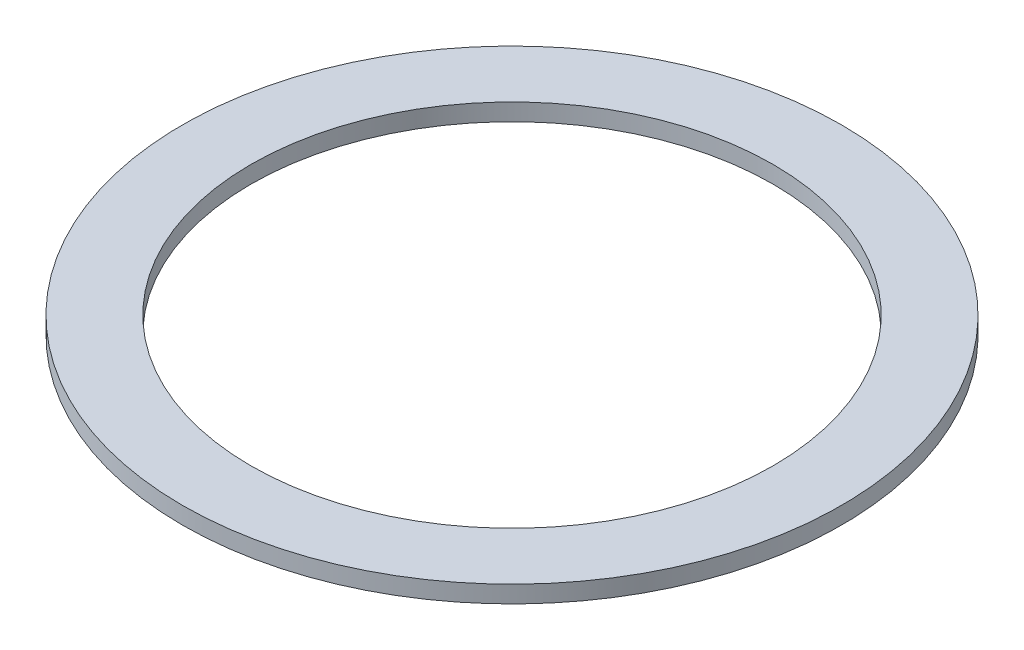
ISO-10303-21;
HEADER;
FILE_DESCRIPTION(('STEP AP214'),'2;1');
FILE_NAME('part.step','',(''),(''),'','','');
FILE_SCHEMA(('AUTOMOTIVE_DESIGN { 1 0 10303 214 1 1 1 1 }'));
ENDSEC;
DATA;
#1=APPLICATION_CONTEXT('core data for automotive mechanical design processes');
#2=APPLICATION_PROTOCOL_DEFINITION('international standard','automotive_design',2000,#1);
#3=PRODUCT_CONTEXT('',#1,'mechanical');
#4=PRODUCT('Part','Part','',(#3));
#5=PRODUCT_RELATED_PRODUCT_CATEGORY('part','',(#4));
#6=PRODUCT_DEFINITION_FORMATION('','',#4);
#7=PRODUCT_DEFINITION_CONTEXT('part definition',#1,'design');
#8=PRODUCT_DEFINITION('design','',#6,#7);
#9=PRODUCT_DEFINITION_SHAPE('','',#8);
#10=(LENGTH_UNIT() NAMED_UNIT(*) SI_UNIT(.MILLI.,.METRE.));
#11=(NAMED_UNIT(*) PLANE_ANGLE_UNIT() SI_UNIT($,.RADIAN.));
#12=(NAMED_UNIT(*) SI_UNIT($,.STERADIAN.) SOLID_ANGLE_UNIT());
#13=UNCERTAINTY_MEASURE_WITH_UNIT(LENGTH_MEASURE(1.E-05),#10,'distance_accuracy_value','');
#14=(GEOMETRIC_REPRESENTATION_CONTEXT(3) GLOBAL_UNCERTAINTY_ASSIGNED_CONTEXT((#13)) GLOBAL_UNIT_ASSIGNED_CONTEXT((#10,
#11,#12)) REPRESENTATION_CONTEXT('',''));
#15=CARTESIAN_POINT('',(0.,0.,0.));
#16=DIRECTION('',(0.,0.,1.));
#17=DIRECTION('',(1.,0.,0.));
#18=AXIS2_PLACEMENT_3D('',#15,#16,#17);
#19=CARTESIAN_POINT('',(0.,1.,0.));
#20=DIRECTION('',(0.,1.,0.));
#21=DIRECTION('',(0.,0.,1.));
#22=AXIS2_PLACEMENT_3D('',#19,#20,#21);
#23=PLANE('',#22);
#24=CARTESIAN_POINT('',(0.,1.,0.));
#25=DIRECTION('',(0.,1.,0.));
#26=DIRECTION('',(0.,0.,1.));
#27=AXIS2_PLACEMENT_3D('',#24,#25,#26);
#28=CIRCLE('',#27,19.25);
#29=CARTESIAN_POINT('',(0.,1.,19.25));
#30=VERTEX_POINT('',#29);
#31=EDGE_CURVE('E10',#30,#30,#28,.T.);
#32=ORIENTED_EDGE('',*,*,#31,.T.);
#33=EDGE_LOOP('',(#32));
#34=FACE_BOUND('',#33,.T.);
#35=CARTESIAN_POINT('',(0.,1.,0.));
#36=DIRECTION('',(0.,1.,0.));
#37=DIRECTION('',(0.,0.,1.));
#38=AXIS2_PLACEMENT_3D('',#35,#36,#37);
#39=CIRCLE('',#38,15.25);
#40=CARTESIAN_POINT('',(0.,1.,15.25));
#41=VERTEX_POINT('',#40);
#42=EDGE_CURVE('E42',#41,#41,#39,.T.);
#43=ORIENTED_EDGE('',*,*,#42,.F.);
#44=EDGE_LOOP('',(#43));
#45=FACE_BOUND('',#44,.T.);
#46=ADVANCED_FACE('F31',(#34,#45),#23,.T.);
#47=CARTESIAN_POINT('',(0.,0.,0.));
#48=DIRECTION('',(0.,1.,0.));
#49=DIRECTION('',(0.,0.,1.));
#50=AXIS2_PLACEMENT_3D('',#47,#48,#49);
#51=PLANE('',#50);
#52=CARTESIAN_POINT('',(0.,0.,0.));
#53=DIRECTION('',(0.,1.,0.));
#54=DIRECTION('',(0.,0.,1.));
#55=AXIS2_PLACEMENT_3D('',#52,#53,#54);
#56=CIRCLE('',#55,19.25);
#57=CARTESIAN_POINT('',(0.,0.,19.25));
#58=VERTEX_POINT('',#57);
#59=EDGE_CURVE('E35',#58,#58,#56,.T.);
#60=ORIENTED_EDGE('',*,*,#59,.F.);
#61=EDGE_LOOP('',(#60));
#62=FACE_BOUND('',#61,.T.);
#63=CARTESIAN_POINT('',(0.,0.,0.));
#64=DIRECTION('',(0.,1.,0.));
#65=DIRECTION('',(0.,0.,1.));
#66=AXIS2_PLACEMENT_3D('',#63,#64,#65);
#67=CIRCLE('',#66,15.25);
#68=CARTESIAN_POINT('',(0.,0.,15.25));
#69=VERTEX_POINT('',#68);
#70=EDGE_CURVE('E44',#69,#69,#67,.T.);
#71=ORIENTED_EDGE('',*,*,#70,.T.);
#72=EDGE_LOOP('',(#71));
#73=FACE_BOUND('',#72,.T.);
#74=ADVANCED_FACE('F54',(#62,#73),#51,.F.);
#75=CARTESIAN_POINT('',(0.,1.,0.));
#76=DIRECTION('',(0.,-1.,0.));
#77=DIRECTION('',(0.,0.,-1.));
#78=AXIS2_PLACEMENT_3D('',#75,#76,#77);
#79=CYLINDRICAL_SURFACE('',#78,19.25);
#80=ORIENTED_EDGE('',*,*,#31,.F.);
#81=EDGE_LOOP('',(#80));
#82=FACE_BOUND('',#81,.T.);
#83=ORIENTED_EDGE('',*,*,#59,.T.);
#84=EDGE_LOOP('',(#83));
#85=FACE_BOUND('',#84,.T.);
#86=ADVANCED_FACE('F33',(#82,#85),#79,.T.);
#87=CARTESIAN_POINT('',(0.,1.,0.));
#88=DIRECTION('',(0.,-1.,0.));
#89=DIRECTION('',(0.,0.,-1.));
#90=AXIS2_PLACEMENT_3D('',#87,#88,#89);
#91=CYLINDRICAL_SURFACE('',#90,15.25);
#92=ORIENTED_EDGE('',*,*,#42,.T.);
#93=EDGE_LOOP('',(#92));
#94=FACE_BOUND('',#93,.T.);
#95=ORIENTED_EDGE('',*,*,#70,.F.);
#96=EDGE_LOOP('',(#95));
#97=FACE_BOUND('',#96,.T.);
#98=ADVANCED_FACE('F50',(#94,#97),#91,.F.);
#99=CLOSED_SHELL('',(#46,#74,#86,#98));
#100=MANIFOLD_SOLID_BREP('B2',#99);
#101=ADVANCED_BREP_SHAPE_REPRESENTATION('',(#18,#100),#14);
#102=SHAPE_DEFINITION_REPRESENTATION(#9,#101);
ENDSEC;
END-ISO-10303-21;
